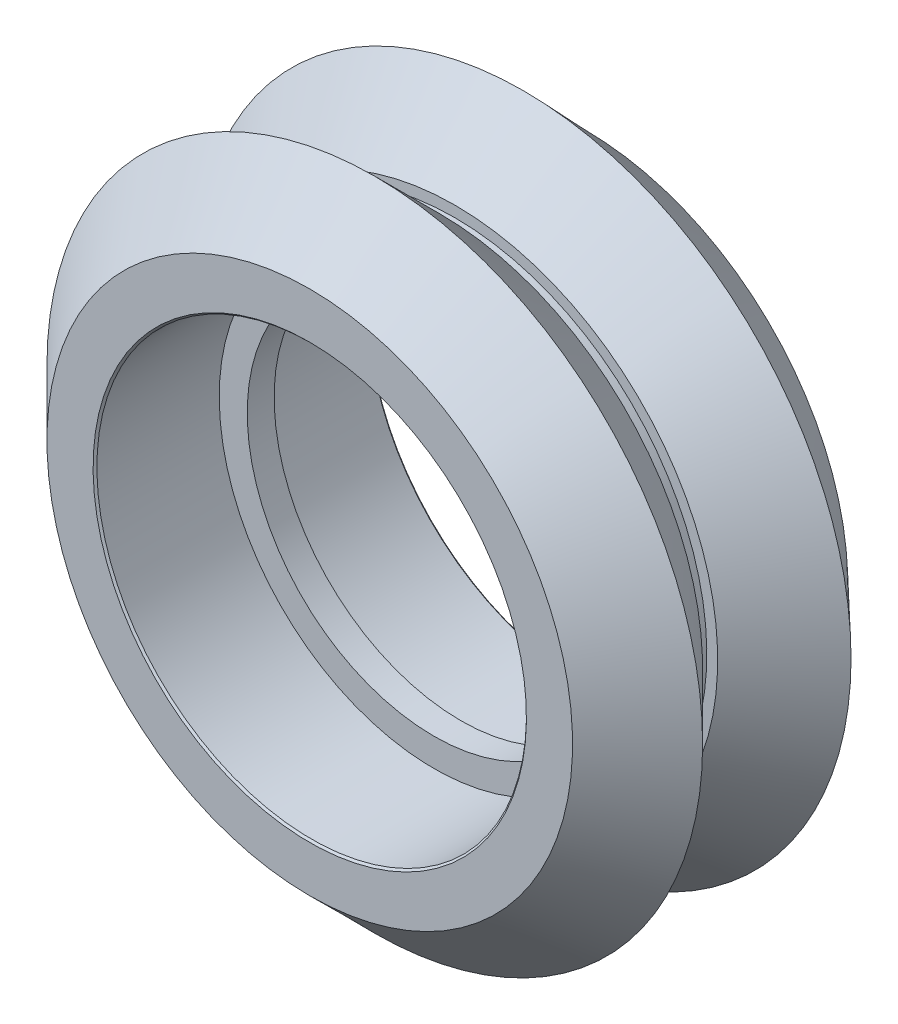
ISO-10303-21;
HEADER;
FILE_DESCRIPTION(('STEP AP214'),'2;1');
FILE_NAME('part.step','',(''),(''),'','','');
FILE_SCHEMA(('AUTOMOTIVE_DESIGN { 1 0 10303 214 1 1 1 1 }'));
ENDSEC;
DATA;
#1=APPLICATION_CONTEXT('core data for automotive mechanical design processes');
#2=APPLICATION_PROTOCOL_DEFINITION('international standard','automotive_design',2000,#1);
#3=PRODUCT_CONTEXT('',#1,'mechanical');
#4=PRODUCT('Part','Part','',(#3));
#5=PRODUCT_RELATED_PRODUCT_CATEGORY('part','',(#4));
#6=PRODUCT_DEFINITION_FORMATION('','',#4);
#7=PRODUCT_DEFINITION_CONTEXT('part definition',#1,'design');
#8=PRODUCT_DEFINITION('design','',#6,#7);
#9=PRODUCT_DEFINITION_SHAPE('','',#8);
#10=(LENGTH_UNIT() NAMED_UNIT(*) SI_UNIT(.MILLI.,.METRE.));
#11=(NAMED_UNIT(*) PLANE_ANGLE_UNIT() SI_UNIT($,.RADIAN.));
#12=(NAMED_UNIT(*) SI_UNIT($,.STERADIAN.) SOLID_ANGLE_UNIT());
#13=UNCERTAINTY_MEASURE_WITH_UNIT(LENGTH_MEASURE(1.E-05),#10,'distance_accuracy_value','');
#14=(GEOMETRIC_REPRESENTATION_CONTEXT(3) GLOBAL_UNCERTAINTY_ASSIGNED_CONTEXT((#13)) GLOBAL_UNIT_ASSIGNED_CONTEXT((#10,
#11,#12)) REPRESENTATION_CONTEXT('',''));
#15=CARTESIAN_POINT('',(0.,0.,0.));
#16=DIRECTION('',(0.,0.,1.));
#17=DIRECTION('',(1.,0.,0.));
#18=AXIS2_PLACEMENT_3D('',#15,#16,#17);
#19=CARTESIAN_POINT('',(0.,7.987,0.504999999999999));
#20=DIRECTION('',(0.,0.,-1.));
#21=DIRECTION('',(-1.,0.,0.));
#22=AXIS2_PLACEMENT_3D('',#19,#20,#21);
#23=PLANE('',#22);
#24=CARTESIAN_POINT('',(0.,0.,0.504999999999999));
#25=DIRECTION('',(0.,0.,1.));
#26=DIRECTION('',(0.,1.,0.));
#27=AXIS2_PLACEMENT_3D('',#24,#25,#26);
#28=CIRCLE('',#27,7.987);
#29=CARTESIAN_POINT('',(0.,7.987,0.504999999999999));
#30=VERTEX_POINT('',#29);
#31=EDGE_CURVE('E102',#30,#30,#28,.T.);
#32=ORIENTED_EDGE('',*,*,#31,.T.);
#33=EDGE_LOOP('',(#32));
#34=FACE_BOUND('',#33,.T.);
#35=CARTESIAN_POINT('',(0.,0.,0.504999999999999));
#36=DIRECTION('',(0.,0.,1.));
#37=DIRECTION('',(0.,1.,0.));
#38=AXIS2_PLACEMENT_3D('',#35,#36,#37);
#39=CIRCLE('',#38,6.945);
#40=CARTESIAN_POINT('',(0.,6.945,0.504999999999999));
#41=VERTEX_POINT('',#40);
#42=EDGE_CURVE('E104',#41,#41,#39,.T.);
#43=ORIENTED_EDGE('',*,*,#42,.F.);
#44=EDGE_LOOP('',(#43));
#45=FACE_BOUND('',#44,.T.);
#46=ADVANCED_FACE('F32',(#34,#45),#23,.F.);
#47=CARTESIAN_POINT('',(0.,0.,0.));
#48=DIRECTION('',(0.,0.,1.));
#49=DIRECTION('',(1.,0.,0.));
#50=AXIS2_PLACEMENT_3D('',#47,#48,#49);
#51=CYLINDRICAL_SURFACE('',#50,6.945);
#52=DIRECTION('',(0.,0.,-1.));
#53=VECTOR('',#52,1.);
#54=CARTESIAN_POINT('',(0.,6.945,0.504999999999999));
#55=LINE('',#54,#53);
#56=CARTESIAN_POINT('',(0.,6.945,-0.495000000000001));
#57=VERTEX_POINT('',#56);
#58=EDGE_CURVE('E106',#41,#57,#55,.T.);
#59=ORIENTED_EDGE('',*,*,#58,.T.);
#60=CARTESIAN_POINT('',(0.,0.,-0.495000000000001));
#61=DIRECTION('',(0.,0.,1.));
#62=DIRECTION('',(0.,1.,0.));
#63=AXIS2_PLACEMENT_3D('',#60,#61,#62);
#64=CIRCLE('',#63,6.945);
#65=EDGE_CURVE('E112',#57,#57,#64,.T.);
#66=ORIENTED_EDGE('',*,*,#65,.F.);
#67=ORIENTED_EDGE('',*,*,#58,.F.);
#68=ORIENTED_EDGE('',*,*,#42,.T.);
#69=EDGE_LOOP('',(#59,#66,#67,#68));
#70=FACE_BOUND('',#69,.T.);
#71=ADVANCED_FACE('F222',(#70),#51,.F.);
#72=CARTESIAN_POINT('',(0.,6.945,-0.495000000000001));
#73=DIRECTION('',(0.,0.,1.));
#74=DIRECTION('',(1.,0.,0.));
#75=AXIS2_PLACEMENT_3D('',#72,#73,#74);
#76=PLANE('',#75);
#77=ORIENTED_EDGE('',*,*,#65,.T.);
#78=EDGE_LOOP('',(#77));
#79=FACE_BOUND('',#78,.T.);
#80=CARTESIAN_POINT('',(0.,0.,-0.495000000000001));
#81=DIRECTION('',(0.,0.,1.));
#82=DIRECTION('',(0.,1.,0.));
#83=AXIS2_PLACEMENT_3D('',#80,#81,#82);
#84=CIRCLE('',#83,7.987);
#85=CARTESIAN_POINT('',(0.,7.987,-0.495000000000001));
#86=VERTEX_POINT('',#85);
#87=EDGE_CURVE('E116',#86,#86,#84,.T.);
#88=ORIENTED_EDGE('',*,*,#87,.F.);
#89=EDGE_LOOP('',(#88));
#90=FACE_BOUND('',#89,.T.);
#91=ADVANCED_FACE('F219',(#79,#90),#76,.F.);
#92=CARTESIAN_POINT('',(0.,0.,0.));
#93=DIRECTION('',(0.,0.,1.));
#94=DIRECTION('',(1.,0.,0.));
#95=AXIS2_PLACEMENT_3D('',#92,#93,#94);
#96=CYLINDRICAL_SURFACE('',#95,7.987);
#97=DIRECTION('',(0.,0.,-1.));
#98=VECTOR('',#97,1.);
#99=CARTESIAN_POINT('',(0.,7.987,-0.495000000000001));
#100=LINE('',#99,#98);
#101=CARTESIAN_POINT('',(0.,7.987,-5.04428932188135));
#102=VERTEX_POINT('',#101);
#103=EDGE_CURVE('E118',#86,#102,#100,.T.);
#104=ORIENTED_EDGE('',*,*,#103,.T.);
#105=CARTESIAN_POINT('',(0.,0.,-5.04428932188135));
#106=DIRECTION('',(0.,0.,1.));
#107=DIRECTION('',(0.,1.,0.));
#108=AXIS2_PLACEMENT_3D('',#105,#106,#107);
#109=CIRCLE('',#108,7.987);
#110=EDGE_CURVE('E121',#102,#102,#109,.T.);
#111=ORIENTED_EDGE('',*,*,#110,.F.);
#112=ORIENTED_EDGE('',*,*,#103,.F.);
#113=ORIENTED_EDGE('',*,*,#87,.T.);
#114=EDGE_LOOP('',(#104,#111,#112,#113));
#115=FACE_BOUND('',#114,.T.);
#116=ADVANCED_FACE('F215',(#115),#96,.F.);
#117=CARTESIAN_POINT('',(0.,0.,-5.04428932188135));
#118=DIRECTION('',(0.,0.,-1.));
#119=DIRECTION('',(-1.,0.,0.));
#120=AXIS2_PLACEMENT_3D('',#117,#118,#119);
#121=CONICAL_SURFACE('',#120,7.987,0.785398163397436);
#122=DIRECTION('',(0.,0.707106781186539,-0.707106781186556));
#123=VECTOR('',#122,1.);
#124=CARTESIAN_POINT('',(0.,7.987,-5.04428932188135));
#125=LINE('',#124,#123);
#126=CARTESIAN_POINT('',(0.,8.05771067811865,-5.115));
#127=VERTEX_POINT('',#126);
#128=EDGE_CURVE('E123',#102,#127,#125,.T.);
#129=ORIENTED_EDGE('',*,*,#128,.T.);
#130=CARTESIAN_POINT('',(0.,0.,-5.115));
#131=DIRECTION('',(0.,0.,1.));
#132=DIRECTION('',(0.,1.,0.));
#133=AXIS2_PLACEMENT_3D('',#130,#131,#132);
#134=CIRCLE('',#133,8.05771067811865);
#135=EDGE_CURVE('E126',#127,#127,#134,.T.);
#136=ORIENTED_EDGE('',*,*,#135,.F.);
#137=ORIENTED_EDGE('',*,*,#128,.F.);
#138=ORIENTED_EDGE('',*,*,#110,.T.);
#139=EDGE_LOOP('',(#129,#136,#137,#138));
#140=FACE_BOUND('',#139,.T.);
#141=ADVANCED_FACE('F211',(#140),#121,.F.);
#142=CARTESIAN_POINT('',(0.,8.05771067811865,-5.115));
#143=DIRECTION('',(0.,0.,1.));
#144=DIRECTION('',(1.,0.,0.));
#145=AXIS2_PLACEMENT_3D('',#142,#143,#144);
#146=PLANE('',#145);
#147=ORIENTED_EDGE('',*,*,#135,.T.);
#148=EDGE_LOOP('',(#147));
#149=FACE_BOUND('',#148,.T.);
#150=CARTESIAN_POINT('',(0.,0.,-5.115));
#151=DIRECTION('',(0.,0.,1.));
#152=DIRECTION('',(0.,1.,0.));
#153=AXIS2_PLACEMENT_3D('',#150,#151,#152);
#154=CIRCLE('',#153,9.77);
#155=CARTESIAN_POINT('',(0.,9.77,-5.115));
#156=VERTEX_POINT('',#155);
#157=EDGE_CURVE('E131',#156,#156,#154,.T.);
#158=ORIENTED_EDGE('',*,*,#157,.F.);
#159=EDGE_LOOP('',(#158));
#160=FACE_BOUND('',#159,.T.);
#161=ADVANCED_FACE('F207',(#149,#160),#146,.F.);
#162=CARTESIAN_POINT('',(0.,0.,-5.115));
#163=DIRECTION('',(0.,0.,1.));
#164=DIRECTION('',(1.,0.,0.));
#165=AXIS2_PLACEMENT_3D('',#162,#163,#164);
#166=CONICAL_SURFACE('',#165,9.77,0.8107092125403);
#167=DIRECTION('',(0.,0.724775993112463,0.688984586045177));
#168=VECTOR('',#167,1.);
#169=CARTESIAN_POINT('',(0.,9.77,-5.115));
#170=LINE('',#169,#168);
#171=CARTESIAN_POINT('',(0.,12.1868999199359,-2.81745316253004));
#172=VERTEX_POINT('',#171);
#173=EDGE_CURVE('E133',#156,#172,#170,.T.);
#174=ORIENTED_EDGE('',*,*,#173,.T.);
#175=CARTESIAN_POINT('',(0.,0.,-2.81745316253004));
#176=DIRECTION('',(0.,0.,1.));
#177=DIRECTION('',(0.,1.,0.));
#178=AXIS2_PLACEMENT_3D('',#175,#176,#177);
#179=CIRCLE('',#178,12.1868999199359);
#180=EDGE_CURVE('E136',#172,#172,#179,.T.);
#181=ORIENTED_EDGE('',*,*,#180,.F.);
#182=ORIENTED_EDGE('',*,*,#173,.F.);
#183=ORIENTED_EDGE('',*,*,#157,.T.);
#184=EDGE_LOOP('',(#174,#181,#182,#183));
#185=FACE_BOUND('',#184,.T.);
#186=ADVANCED_FACE('F203',(#185),#166,.T.);
#187=CARTESIAN_POINT('',(0.,0.,-2.81745316253004));
#188=DIRECTION('',(0.,0.,-1.));
#189=DIRECTION('',(-1.,0.,0.));
#190=AXIS2_PLACEMENT_3D('',#187,#188,#189);
#191=CONICAL_SURFACE('',#190,12.1868999199359,0.760087114254597);
#192=DIRECTION('',(0.,-0.688984586045177,0.724775993112463));
#193=VECTOR('',#192,1.);
#194=CARTESIAN_POINT('',(0.,12.1868999199359,-2.81745316253004));
#195=LINE('',#194,#193);
#196=CARTESIAN_POINT('',(0.,9.77,-0.275000000000001));
#197=VERTEX_POINT('',#196);
#198=EDGE_CURVE('E138',#172,#197,#195,.T.);
#199=ORIENTED_EDGE('',*,*,#198,.T.);
#200=CARTESIAN_POINT('',(0.,0.,-0.275000000000001));
#201=DIRECTION('',(0.,0.,1.));
#202=DIRECTION('',(0.,1.,0.));
#203=AXIS2_PLACEMENT_3D('',#200,#201,#202);
#204=CIRCLE('',#203,9.77);
#205=EDGE_CURVE('E141',#197,#197,#204,.T.);
#206=ORIENTED_EDGE('',*,*,#205,.F.);
#207=ORIENTED_EDGE('',*,*,#198,.F.);
#208=ORIENTED_EDGE('',*,*,#180,.T.);
#209=EDGE_LOOP('',(#199,#206,#207,#208));
#210=FACE_BOUND('',#209,.T.);
#211=ADVANCED_FACE('F199',(#210),#191,.T.);
#212=CARTESIAN_POINT('',(0.,0.,-0.275000000000001));
#213=DIRECTION('',(0.,0.,-1.));
#214=DIRECTION('',(-1.,0.,0.));
#215=AXIS2_PLACEMENT_3D('',#212,#213,#214);
#216=CONICAL_SURFACE('',#215,9.77,1.54548527765205);
#217=DIRECTION('',(0.,-0.999679692496588,0.0253083466454847));
#218=VECTOR('',#217,1.);
#219=CARTESIAN_POINT('',(0.,9.77,-0.275000000000001));
#220=LINE('',#219,#218);
#221=CARTESIAN_POINT('',(0.,9.375,-0.265));
#222=VERTEX_POINT('',#221);
#223=EDGE_CURVE('E143',#197,#222,#220,.T.);
#224=ORIENTED_EDGE('',*,*,#223,.T.);
#225=CARTESIAN_POINT('',(0.,0.,-0.265));
#226=DIRECTION('',(0.,0.,1.));
#227=DIRECTION('',(0.,1.,0.));
#228=AXIS2_PLACEMENT_3D('',#225,#226,#227);
#229=CIRCLE('',#228,9.375);
#230=EDGE_CURVE('E146',#222,#222,#229,.T.);
#231=ORIENTED_EDGE('',*,*,#230,.F.);
#232=ORIENTED_EDGE('',*,*,#223,.F.);
#233=ORIENTED_EDGE('',*,*,#205,.T.);
#234=EDGE_LOOP('',(#224,#231,#232,#233));
#235=FACE_BOUND('',#234,.T.);
#236=ADVANCED_FACE('F195',(#235),#216,.T.);
#237=CARTESIAN_POINT('',(0.,0.,0.));
#238=DIRECTION('',(0.,0.,1.));
#239=DIRECTION('',(1.,0.,0.));
#240=AXIS2_PLACEMENT_3D('',#237,#238,#239);
#241=CYLINDRICAL_SURFACE('',#240,9.375);
#242=DIRECTION('',(0.,0.,1.));
#243=VECTOR('',#242,1.);
#244=CARTESIAN_POINT('',(0.,9.375,-0.265));
#245=LINE('',#244,#243);
#246=CARTESIAN_POINT('',(0.,9.375,0.285));
#247=VERTEX_POINT('',#246);
#248=EDGE_CURVE('E148',#222,#247,#245,.T.);
#249=ORIENTED_EDGE('',*,*,#248,.T.);
#250=CARTESIAN_POINT('',(0.,0.,0.285));
#251=DIRECTION('',(0.,0.,1.));
#252=DIRECTION('',(0.,1.,0.));
#253=AXIS2_PLACEMENT_3D('',#250,#251,#252);
#254=CIRCLE('',#253,9.375);
#255=EDGE_CURVE('E151',#247,#247,#254,.T.);
#256=ORIENTED_EDGE('',*,*,#255,.F.);
#257=ORIENTED_EDGE('',*,*,#248,.F.);
#258=ORIENTED_EDGE('',*,*,#230,.T.);
#259=EDGE_LOOP('',(#249,#256,#257,#258));
#260=FACE_BOUND('',#259,.T.);
#261=ADVANCED_FACE('F191',(#260),#241,.T.);
#262=CARTESIAN_POINT('',(0.,9.375,0.285));
#263=DIRECTION('',(0.,0.,1.));
#264=DIRECTION('',(1.,0.,0.));
#265=AXIS2_PLACEMENT_3D('',#262,#263,#264);
#266=PLANE('',#265);
#267=ORIENTED_EDGE('',*,*,#255,.T.);
#268=EDGE_LOOP('',(#267));
#269=FACE_BOUND('',#268,.T.);
#270=CARTESIAN_POINT('',(0.,0.,0.285));
#271=DIRECTION('',(0.,0.,1.));
#272=DIRECTION('',(0.,1.,0.));
#273=AXIS2_PLACEMENT_3D('',#270,#271,#272);
#274=CIRCLE('',#273,9.77);
#275=CARTESIAN_POINT('',(0.,9.77,0.285));
#276=VERTEX_POINT('',#275);
#277=EDGE_CURVE('E156',#276,#276,#274,.T.);
#278=ORIENTED_EDGE('',*,*,#277,.F.);
#279=EDGE_LOOP('',(#278));
#280=FACE_BOUND('',#279,.T.);
#281=ADVANCED_FACE('F187',(#269,#280),#266,.F.);
#282=CARTESIAN_POINT('',(0.,0.,0.285));
#283=DIRECTION('',(0.,0.,1.));
#284=DIRECTION('',(1.,0.,0.));
#285=AXIS2_PLACEMENT_3D('',#282,#283,#284);
#286=CONICAL_SURFACE('',#285,9.77,0.785398163397446);
#287=DIRECTION('',(0.,0.707106781186546,0.707106781186549));
#288=VECTOR('',#287,1.);
#289=CARTESIAN_POINT('',(0.,9.77,0.285));
#290=LINE('',#289,#288);
#291=CARTESIAN_POINT('',(0.,12.191694808342,2.70669480834201));
#292=VERTEX_POINT('',#291);
#293=EDGE_CURVE('E158',#276,#292,#290,.T.);
#294=ORIENTED_EDGE('',*,*,#293,.T.);
#295=CARTESIAN_POINT('',(0.,0.,2.70669480834201));
#296=DIRECTION('',(0.,0.,1.));
#297=DIRECTION('',(0.,1.,0.));
#298=AXIS2_PLACEMENT_3D('',#295,#296,#297);
#299=CIRCLE('',#298,12.191694808342);
#300=EDGE_CURVE('E161',#292,#292,#299,.T.);
#301=ORIENTED_EDGE('',*,*,#300,.F.);
#302=ORIENTED_EDGE('',*,*,#293,.F.);
#303=ORIENTED_EDGE('',*,*,#277,.T.);
#304=EDGE_LOOP('',(#294,#301,#302,#303));
#305=FACE_BOUND('',#304,.T.);
#306=ADVANCED_FACE('F183',(#305),#286,.T.);
#307=CARTESIAN_POINT('',(0.,0.,2.70669480834201));
#308=DIRECTION('',(0.,0.,-1.));
#309=DIRECTION('',(-1.,0.,0.));
#310=AXIS2_PLACEMENT_3D('',#307,#308,#309);
#311=CONICAL_SURFACE('',#310,12.191694808342,0.785398163397446);
#312=DIRECTION('',(0.,-0.707106781186546,0.707106781186549));
#313=VECTOR('',#312,1.);
#314=CARTESIAN_POINT('',(0.,12.191694808342,2.70669480834201));
#315=LINE('',#314,#313);
#316=CARTESIAN_POINT('',(0.,9.77338961668402,5.125));
#317=VERTEX_POINT('',#316);
#318=EDGE_CURVE('E163',#292,#317,#315,.T.);
#319=ORIENTED_EDGE('',*,*,#318,.T.);
#320=CARTESIAN_POINT('',(0.,0.,5.125));
#321=DIRECTION('',(0.,0.,1.));
#322=DIRECTION('',(0.,1.,0.));
#323=AXIS2_PLACEMENT_3D('',#320,#321,#322);
#324=CIRCLE('',#323,9.77338961668402);
#325=EDGE_CURVE('E166',#317,#317,#324,.T.);
#326=ORIENTED_EDGE('',*,*,#325,.F.);
#327=ORIENTED_EDGE('',*,*,#318,.F.);
#328=ORIENTED_EDGE('',*,*,#300,.T.);
#329=EDGE_LOOP('',(#319,#326,#327,#328));
#330=FACE_BOUND('',#329,.T.);
#331=ADVANCED_FACE('F179',(#330),#311,.T.);
#332=CARTESIAN_POINT('',(0.,9.77338961668402,5.125));
#333=DIRECTION('',(0.,0.,-1.));
#334=DIRECTION('',(-1.,0.,0.));
#335=AXIS2_PLACEMENT_3D('',#332,#333,#334);
#336=PLANE('',#335);
#337=ORIENTED_EDGE('',*,*,#325,.T.);
#338=EDGE_LOOP('',(#337));
#339=FACE_BOUND('',#338,.T.);
#340=CARTESIAN_POINT('',(0.,0.,5.12499999999999));
#341=DIRECTION('',(0.,0.,1.));
#342=DIRECTION('',(0.,1.,0.));
#343=AXIS2_PLACEMENT_3D('',#340,#341,#342);
#344=CIRCLE('',#343,8.05771067811865);
#345=CARTESIAN_POINT('',(0.,8.05771067811865,5.12499999999999));
#346=VERTEX_POINT('',#345);
#347=EDGE_CURVE('E41',#346,#346,#344,.T.);
#348=ORIENTED_EDGE('',*,*,#347,.F.);
#349=EDGE_LOOP('',(#348));
#350=FACE_BOUND('',#349,.T.);
#351=ADVANCED_FACE('F175',(#339,#350),#336,.F.);
#352=CARTESIAN_POINT('',(0.,0.,5.12499999999999));
#353=DIRECTION('',(0.,0.,1.));
#354=DIRECTION('',(1.,0.,0.));
#355=AXIS2_PLACEMENT_3D('',#352,#353,#354);
#356=CONICAL_SURFACE('',#355,8.05771067811865,0.785398163397418);
#357=DIRECTION('',(0.,-0.707106781186526,-0.707106781186569));
#358=VECTOR('',#357,1.);
#359=CARTESIAN_POINT('',(0.,8.05771067811865,5.12499999999999));
#360=LINE('',#359,#358);
#361=CARTESIAN_POINT('',(0.,7.987,5.05428932188133));
#362=VERTEX_POINT('',#361);
#363=EDGE_CURVE('E48',#346,#362,#360,.T.);
#364=ORIENTED_EDGE('',*,*,#363,.T.);
#365=CARTESIAN_POINT('',(0.,0.,5.05428932188133));
#366=DIRECTION('',(0.,0.,1.));
#367=DIRECTION('',(0.,1.,0.));
#368=AXIS2_PLACEMENT_3D('',#365,#366,#367);
#369=CIRCLE('',#368,7.987);
#370=EDGE_CURVE('E11',#362,#362,#369,.T.);
#371=ORIENTED_EDGE('',*,*,#370,.F.);
#372=ORIENTED_EDGE('',*,*,#363,.F.);
#373=ORIENTED_EDGE('',*,*,#347,.T.);
#374=EDGE_LOOP('',(#364,#371,#372,#373));
#375=FACE_BOUND('',#374,.T.);
#376=ADVANCED_FACE('F174',(#375),#356,.F.);
#377=CARTESIAN_POINT('',(0.,0.,0.));
#378=DIRECTION('',(0.,0.,1.));
#379=DIRECTION('',(1.,0.,0.));
#380=AXIS2_PLACEMENT_3D('',#377,#378,#379);
#381=CYLINDRICAL_SURFACE('',#380,7.987);
#382=DIRECTION('',(0.,0.,-1.));
#383=VECTOR('',#382,1.);
#384=CARTESIAN_POINT('',(0.,7.987,5.05428932188133));
#385=LINE('',#384,#383);
#386=EDGE_CURVE('E36',#362,#30,#385,.T.);
#387=ORIENTED_EDGE('',*,*,#386,.T.);
#388=ORIENTED_EDGE('',*,*,#31,.F.);
#389=ORIENTED_EDGE('',*,*,#386,.F.);
#390=ORIENTED_EDGE('',*,*,#370,.T.);
#391=EDGE_LOOP('',(#387,#388,#389,#390));
#392=FACE_BOUND('',#391,.T.);
#393=ADVANCED_FACE('F34',(#392),#381,.F.);
#394=CLOSED_SHELL('',(#46,#71,#91,#116,#141,#161,#186,#211,#236,#261,#281,#306,#331,#351,#376,#393));
#395=MANIFOLD_SOLID_BREP('B2',#394);
#396=ADVANCED_BREP_SHAPE_REPRESENTATION('',(#18,#395),#14);
#397=SHAPE_DEFINITION_REPRESENTATION(#9,#396);
ENDSEC;
END-ISO-10303-21;
